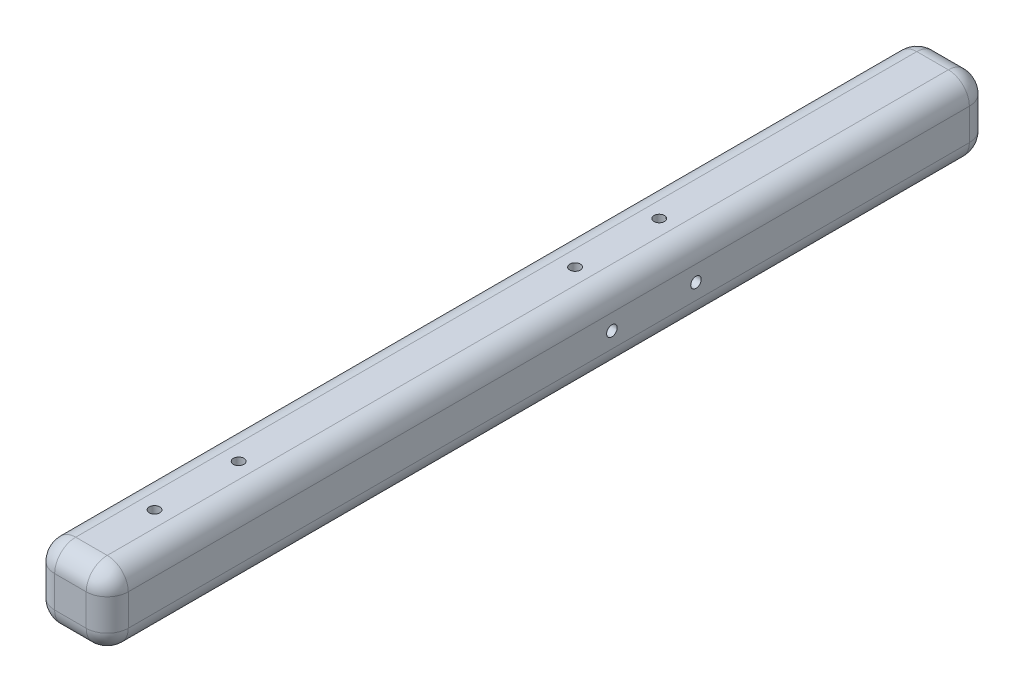
ISO-10303-21;
HEADER;
FILE_DESCRIPTION(('STEP AP214'),'2;1');
FILE_NAME('part.step','',(''),(''),'','','');
FILE_SCHEMA(('AUTOMOTIVE_DESIGN { 1 0 10303 214 1 1 1 1 }'));
ENDSEC;
DATA;
#1=APPLICATION_CONTEXT('core data for automotive mechanical design processes');
#2=APPLICATION_PROTOCOL_DEFINITION('international standard','automotive_design',2000,#1);
#3=PRODUCT_CONTEXT('',#1,'mechanical');
#4=PRODUCT('Part','Part','',(#3));
#5=PRODUCT_RELATED_PRODUCT_CATEGORY('part','',(#4));
#6=PRODUCT_DEFINITION_FORMATION('','',#4);
#7=PRODUCT_DEFINITION_CONTEXT('part definition',#1,'design');
#8=PRODUCT_DEFINITION('design','',#6,#7);
#9=PRODUCT_DEFINITION_SHAPE('','',#8);
#10=(LENGTH_UNIT() NAMED_UNIT(*) SI_UNIT(.MILLI.,.METRE.));
#11=(NAMED_UNIT(*) PLANE_ANGLE_UNIT() SI_UNIT($,.RADIAN.));
#12=(NAMED_UNIT(*) SI_UNIT($,.STERADIAN.) SOLID_ANGLE_UNIT());
#13=UNCERTAINTY_MEASURE_WITH_UNIT(LENGTH_MEASURE(1.E-05),#10,'distance_accuracy_value','');
#14=(GEOMETRIC_REPRESENTATION_CONTEXT(3) GLOBAL_UNCERTAINTY_ASSIGNED_CONTEXT((#13)) GLOBAL_UNIT_ASSIGNED_CONTEXT((#10,
#11,#12)) REPRESENTATION_CONTEXT('',''));
#15=CARTESIAN_POINT('',(0.,0.,0.));
#16=DIRECTION('',(0.,0.,1.));
#17=DIRECTION('',(1.,0.,0.));
#18=AXIS2_PLACEMENT_3D('',#15,#16,#17);
#19=CARTESIAN_POINT('',(-9.525,-9.525,254.));
#20=DIRECTION('',(0.,0.,-1.));
#21=DIRECTION('',(-1.,0.,0.));
#22=AXIS2_PLACEMENT_3D('',#19,#20,#21);
#23=CYLINDRICAL_SURFACE('',#22,12.7);
#24=DIRECTION('',(0.,0.,-1.));
#25=VECTOR('',#24,1.);
#26=CARTESIAN_POINT('',(-9.52499999999991,-22.225,254.));
#27=LINE('',#26,#25);
#28=CARTESIAN_POINT('',(-9.52499999999991,-22.225,520.7));
#29=VERTEX_POINT('',#28);
#30=CARTESIAN_POINT('',(-9.52499999999991,-22.225,12.7));
#31=VERTEX_POINT('',#30);
#32=EDGE_CURVE('E154',#29,#31,#27,.T.);
#33=ORIENTED_EDGE('',*,*,#32,.F.);
#34=CARTESIAN_POINT('',(-9.525,-9.525,520.7));
#35=DIRECTION('',(0.,0.,-1.));
#36=DIRECTION('',(-1.,0.,0.));
#37=AXIS2_PLACEMENT_3D('',#34,#35,#36);
#38=CIRCLE('',#37,12.7);
#39=CARTESIAN_POINT('',(-22.225,-9.52499999999991,520.7));
#40=VERTEX_POINT('',#39);
#41=EDGE_CURVE('E214',#29,#40,#38,.T.);
#42=ORIENTED_EDGE('',*,*,#41,.T.);
#43=DIRECTION('',(0.,0.,-1.));
#44=VECTOR('',#43,1.);
#45=CARTESIAN_POINT('',(-22.225,-9.52499999999991,254.));
#46=LINE('',#45,#44);
#47=CARTESIAN_POINT('',(-22.225,-9.52499999999991,12.7));
#48=VERTEX_POINT('',#47);
#49=EDGE_CURVE('E200',#40,#48,#46,.T.);
#50=ORIENTED_EDGE('',*,*,#49,.T.);
#51=CARTESIAN_POINT('',(-9.525,-9.525,12.7));
#52=DIRECTION('',(0.,0.,-1.));
#53=DIRECTION('',(-1.,0.,0.));
#54=AXIS2_PLACEMENT_3D('',#51,#52,#53);
#55=CIRCLE('',#54,12.7);
#56=EDGE_CURVE('E176',#48,#31,#55,.F.);
#57=ORIENTED_EDGE('',*,*,#56,.T.);
#58=EDGE_LOOP('',(#33,#42,#50,#57));
#59=FACE_BOUND('',#58,.T.);
#60=ADVANCED_FACE('F32',(#59),#23,.T.);
#61=CARTESIAN_POINT('',(-9.52499999999991,-22.225,254.));
#62=DIRECTION('',(0.,1.,0.));
#63=DIRECTION('',(0.,0.,1.));
#64=AXIS2_PLACEMENT_3D('',#61,#62,#63);
#65=PLANE('',#64);
#66=DIRECTION('',(0.,0.,-1.));
#67=VECTOR('',#66,1.);
#68=CARTESIAN_POINT('',(9.52499999999991,-22.225,254.));
#69=LINE('',#68,#67);
#70=CARTESIAN_POINT('',(9.52499999999991,-22.225,520.7));
#71=VERTEX_POINT('',#70);
#72=CARTESIAN_POINT('',(9.52499999999991,-22.225,12.7));
#73=VERTEX_POINT('',#72);
#74=EDGE_CURVE('E158',#71,#73,#69,.T.);
#75=ORIENTED_EDGE('',*,*,#74,.F.);
#76=DIRECTION('',(1.,0.,0.));
#77=VECTOR('',#76,1.);
#78=CARTESIAN_POINT('',(-9.52499999999991,-22.225,520.7));
#79=LINE('',#78,#77);
#80=EDGE_CURVE('E212',#71,#29,#79,.F.);
#81=ORIENTED_EDGE('',*,*,#80,.T.);
#82=ORIENTED_EDGE('',*,*,#32,.T.);
#83=DIRECTION('',(1.,0.,0.));
#84=VECTOR('',#83,1.);
#85=CARTESIAN_POINT('',(9.52499999999991,-22.225,12.7));
#86=LINE('',#85,#84);
#87=EDGE_CURVE('E173',#31,#73,#86,.T.);
#88=ORIENTED_EDGE('',*,*,#87,.T.);
#89=EDGE_LOOP('',(#75,#81,#82,#88));
#90=FACE_BOUND('',#89,.T.);
#91=ADVANCED_FACE('F287',(#90),#65,.F.);
#92=CARTESIAN_POINT('',(9.525,-9.525,254.));
#93=DIRECTION('',(0.,0.,-1.));
#94=DIRECTION('',(-1.,0.,0.));
#95=AXIS2_PLACEMENT_3D('',#92,#93,#94);
#96=CYLINDRICAL_SURFACE('',#95,12.7);
#97=DIRECTION('',(0.,0.,-1.));
#98=VECTOR('',#97,1.);
#99=CARTESIAN_POINT('',(22.225,-9.52499999999991,254.));
#100=LINE('',#99,#98);
#101=CARTESIAN_POINT('',(22.225,-9.52499999999991,520.7));
#102=VERTEX_POINT('',#101);
#103=CARTESIAN_POINT('',(22.225,-9.52499999999991,12.7));
#104=VERTEX_POINT('',#103);
#105=EDGE_CURVE('E276',#102,#104,#100,.T.);
#106=ORIENTED_EDGE('',*,*,#105,.F.);
#107=CARTESIAN_POINT('',(9.525,-9.525,520.7));
#108=DIRECTION('',(0.,0.,-1.));
#109=DIRECTION('',(-1.,0.,0.));
#110=AXIS2_PLACEMENT_3D('',#107,#108,#109);
#111=CIRCLE('',#110,12.7);
#112=EDGE_CURVE('E148',#102,#71,#111,.T.);
#113=ORIENTED_EDGE('',*,*,#112,.T.);
#114=ORIENTED_EDGE('',*,*,#74,.T.);
#115=CARTESIAN_POINT('',(9.525,-9.525,12.7));
#116=DIRECTION('',(0.,0.,-1.));
#117=DIRECTION('',(-1.,0.,0.));
#118=AXIS2_PLACEMENT_3D('',#115,#116,#117);
#119=CIRCLE('',#118,12.7);
#120=EDGE_CURVE('E170',#73,#104,#119,.F.);
#121=ORIENTED_EDGE('',*,*,#120,.T.);
#122=EDGE_LOOP('',(#106,#113,#114,#121));
#123=FACE_BOUND('',#122,.T.);
#124=ADVANCED_FACE('F280',(#123),#96,.T.);
#125=CARTESIAN_POINT('',(22.225,-9.52499999999991,254.));
#126=DIRECTION('',(-1.,0.,0.));
#127=DIRECTION('',(0.,0.,1.));
#128=AXIS2_PLACEMENT_3D('',#125,#126,#127);
#129=PLANE('',#128);
#130=CARTESIAN_POINT('',(22.2250000000006,6.01007305568305E-13,177.799999999995));
#131=DIRECTION('',(1.,0.,0.));
#132=DIRECTION('',(0.,0.,1.));
#133=AXIS2_PLACEMENT_3D('',#130,#131,#132);
#134=CIRCLE('',#133,3.175);
#135=CARTESIAN_POINT('',(22.2250000000006,6.12092758819132E-13,180.974999999995));
#136=VERTEX_POINT('',#135);
#137=EDGE_CURVE('E255',#136,#136,#134,.T.);
#138=ORIENTED_EDGE('',*,*,#137,.F.);
#139=EDGE_LOOP('',(#138));
#140=FACE_BOUND('',#139,.T.);
#141=CARTESIAN_POINT('',(22.2250000000008,6.89690931574916E-13,228.6));
#142=DIRECTION('',(1.,0.,0.));
#143=DIRECTION('',(0.,0.,1.));
#144=AXIS2_PLACEMENT_3D('',#141,#142,#143);
#145=CIRCLE('',#144,3.175);
#146=CARTESIAN_POINT('',(22.2250000000008,7.00776384825743E-13,231.775));
#147=VERTEX_POINT('',#146);
#148=EDGE_CURVE('E245',#147,#147,#145,.T.);
#149=ORIENTED_EDGE('',*,*,#148,.F.);
#150=EDGE_LOOP('',(#149));
#151=FACE_BOUND('',#150,.T.);
#152=DIRECTION('',(0.,0.,-1.));
#153=VECTOR('',#152,1.);
#154=CARTESIAN_POINT('',(22.225,9.52499999999991,254.));
#155=LINE('',#154,#153);
#156=CARTESIAN_POINT('',(22.225,9.52499999999991,520.7));
#157=VERTEX_POINT('',#156);
#158=CARTESIAN_POINT('',(22.225,9.52499999999991,12.7));
#159=VERTEX_POINT('',#158);
#160=EDGE_CURVE('E128',#157,#159,#155,.T.);
#161=ORIENTED_EDGE('',*,*,#160,.F.);
#162=DIRECTION('',(0.,1.,0.));
#163=VECTOR('',#162,1.);
#164=CARTESIAN_POINT('',(22.225,-9.52499999999991,520.7));
#165=LINE('',#164,#163);
#166=EDGE_CURVE('E11',#157,#102,#165,.F.);
#167=ORIENTED_EDGE('',*,*,#166,.T.);
#168=ORIENTED_EDGE('',*,*,#105,.T.);
#169=DIRECTION('',(0.,1.,0.));
#170=VECTOR('',#169,1.);
#171=CARTESIAN_POINT('',(22.225,9.52499999999991,12.7));
#172=LINE('',#171,#170);
#173=EDGE_CURVE('E153',#104,#159,#172,.T.);
#174=ORIENTED_EDGE('',*,*,#173,.T.);
#175=EDGE_LOOP('',(#161,#167,#168,#174));
#176=FACE_BOUND('',#175,.T.);
#177=ADVANCED_FACE('F299',(#140,#151,#176),#129,.F.);
#178=CARTESIAN_POINT('',(9.525,9.525,254.));
#179=DIRECTION('',(0.,0.,-1.));
#180=DIRECTION('',(-1.,0.,0.));
#181=AXIS2_PLACEMENT_3D('',#178,#179,#180);
#182=CYLINDRICAL_SURFACE('',#181,12.7);
#183=DIRECTION('',(0.,0.,-1.));
#184=VECTOR('',#183,1.);
#185=CARTESIAN_POINT('',(9.52499999999991,22.225,254.));
#186=LINE('',#185,#184);
#187=CARTESIAN_POINT('',(9.52499999999991,22.225,520.7));
#188=VERTEX_POINT('',#187);
#189=CARTESIAN_POINT('',(9.52499999999991,22.225,12.7));
#190=VERTEX_POINT('',#189);
#191=EDGE_CURVE('E120',#188,#190,#186,.T.);
#192=ORIENTED_EDGE('',*,*,#191,.F.);
#193=CARTESIAN_POINT('',(9.525,9.525,520.7));
#194=DIRECTION('',(0.,0.,-1.));
#195=DIRECTION('',(-1.,0.,0.));
#196=AXIS2_PLACEMENT_3D('',#193,#194,#195);
#197=CIRCLE('',#196,12.7);
#198=EDGE_CURVE('E41',#188,#157,#197,.T.);
#199=ORIENTED_EDGE('',*,*,#198,.T.);
#200=ORIENTED_EDGE('',*,*,#160,.T.);
#201=CARTESIAN_POINT('',(9.525,9.525,12.7));
#202=DIRECTION('',(0.,0.,-1.));
#203=DIRECTION('',(-1.,0.,0.));
#204=AXIS2_PLACEMENT_3D('',#201,#202,#203);
#205=CIRCLE('',#204,12.7);
#206=EDGE_CURVE('E137',#159,#190,#205,.F.);
#207=ORIENTED_EDGE('',*,*,#206,.T.);
#208=EDGE_LOOP('',(#192,#199,#200,#207));
#209=FACE_BOUND('',#208,.T.);
#210=ADVANCED_FACE('F151',(#209),#182,.T.);
#211=CARTESIAN_POINT('',(-9.52499999999991,22.225,254.));
#212=DIRECTION('',(0.,-1.,0.));
#213=DIRECTION('',(0.,0.,-1.));
#214=AXIS2_PLACEMENT_3D('',#211,#212,#213);
#215=PLANE('',#214);
#216=CARTESIAN_POINT('',(6.62802829628184E-13,22.225,431.800000000005));
#217=DIRECTION('',(0.,1.,0.));
#218=DIRECTION('',(0.,0.,1.));
#219=AXIS2_PLACEMENT_3D('',#216,#217,#218);
#220=CIRCLE('',#219,3.175);
#221=CARTESIAN_POINT('',(6.62802829628184E-13,22.225,434.975000000005));
#222=VERTEX_POINT('',#221);
#223=EDGE_CURVE('E721',#222,#222,#220,.T.);
#224=ORIENTED_EDGE('',*,*,#223,.F.);
#225=EDGE_LOOP('',(#224));
#226=FACE_BOUND('',#225,.T.);
#227=CARTESIAN_POINT('',(7.51486455634769E-13,22.225,482.599999999995));
#228=DIRECTION('',(0.,1.,0.));
#229=DIRECTION('',(0.,0.,1.));
#230=AXIS2_PLACEMENT_3D('',#227,#228,#229);
#231=CIRCLE('',#230,3.175);
#232=CARTESIAN_POINT('',(7.51486455634769E-13,22.225,485.774999999995));
#233=VERTEX_POINT('',#232);
#234=EDGE_CURVE('E715',#233,#233,#231,.T.);
#235=ORIENTED_EDGE('',*,*,#234,.F.);
#236=EDGE_LOOP('',(#235));
#237=FACE_BOUND('',#236,.T.);
#238=CARTESIAN_POINT('',(0.,22.225,177.799999999995));
#239=DIRECTION('',(0.,1.,0.));
#240=DIRECTION('',(0.,0.,1.));
#241=AXIS2_PLACEMENT_3D('',#238,#239,#240);
#242=CIRCLE('',#241,3.175);
#243=CARTESIAN_POINT('',(0.,22.225,180.974999999995));
#244=VERTEX_POINT('',#243);
#245=EDGE_CURVE('E261',#244,#244,#242,.T.);
#246=ORIENTED_EDGE('',*,*,#245,.F.);
#247=EDGE_LOOP('',(#246));
#248=FACE_BOUND('',#247,.T.);
#249=CARTESIAN_POINT('',(0.,22.225,228.6));
#250=DIRECTION('',(0.,1.,0.));
#251=DIRECTION('',(0.,0.,1.));
#252=AXIS2_PLACEMENT_3D('',#249,#250,#251);
#253=CIRCLE('',#252,3.175);
#254=CARTESIAN_POINT('',(0.,22.225,231.775));
#255=VERTEX_POINT('',#254);
#256=EDGE_CURVE('E267',#255,#255,#253,.T.);
#257=ORIENTED_EDGE('',*,*,#256,.F.);
#258=EDGE_LOOP('',(#257));
#259=FACE_BOUND('',#258,.T.);
#260=DIRECTION('',(0.,0.,-1.));
#261=VECTOR('',#260,1.);
#262=CARTESIAN_POINT('',(-9.52499999999991,22.225,254.));
#263=LINE('',#262,#261);
#264=CARTESIAN_POINT('',(-9.52499999999991,22.225,520.7));
#265=VERTEX_POINT('',#264);
#266=CARTESIAN_POINT('',(-9.52499999999991,22.225,12.7));
#267=VERTEX_POINT('',#266);
#268=EDGE_CURVE('E129',#265,#267,#263,.T.);
#269=ORIENTED_EDGE('',*,*,#268,.F.);
#270=DIRECTION('',(-1.,0.,0.));
#271=VECTOR('',#270,1.);
#272=CARTESIAN_POINT('',(-9.52499999999991,22.225,520.7));
#273=LINE('',#272,#271);
#274=EDGE_CURVE('E56',#265,#188,#273,.F.);
#275=ORIENTED_EDGE('',*,*,#274,.T.);
#276=ORIENTED_EDGE('',*,*,#191,.T.);
#277=DIRECTION('',(-1.,0.,0.));
#278=VECTOR('',#277,1.);
#279=CARTESIAN_POINT('',(-9.52499999999991,22.225,12.7));
#280=LINE('',#279,#278);
#281=EDGE_CURVE('E124',#190,#267,#280,.T.);
#282=ORIENTED_EDGE('',*,*,#281,.T.);
#283=EDGE_LOOP('',(#269,#275,#276,#282));
#284=FACE_BOUND('',#283,.T.);
#285=ADVANCED_FACE('F122',(#226,#237,#248,#259,#284),#215,.F.);
#286=CARTESIAN_POINT('',(-9.525,9.525,254.));
#287=DIRECTION('',(0.,0.,-1.));
#288=DIRECTION('',(-1.,0.,0.));
#289=AXIS2_PLACEMENT_3D('',#286,#287,#288);
#290=CYLINDRICAL_SURFACE('',#289,12.7);
#291=DIRECTION('',(0.,0.,-1.));
#292=VECTOR('',#291,1.);
#293=CARTESIAN_POINT('',(-22.225,9.52499999999991,254.));
#294=LINE('',#293,#292);
#295=CARTESIAN_POINT('',(-22.225,9.52499999999991,520.7));
#296=VERTEX_POINT('',#295);
#297=CARTESIAN_POINT('',(-22.225,9.52499999999991,12.7));
#298=VERTEX_POINT('',#297);
#299=EDGE_CURVE('E272',#296,#298,#294,.T.);
#300=ORIENTED_EDGE('',*,*,#299,.F.);
#301=CARTESIAN_POINT('',(-9.525,9.525,520.7));
#302=DIRECTION('',(0.,0.,-1.));
#303=DIRECTION('',(-1.,0.,0.));
#304=AXIS2_PLACEMENT_3D('',#301,#302,#303);
#305=CIRCLE('',#304,12.7);
#306=EDGE_CURVE('E218',#296,#265,#305,.T.);
#307=ORIENTED_EDGE('',*,*,#306,.T.);
#308=ORIENTED_EDGE('',*,*,#268,.T.);
#309=CARTESIAN_POINT('',(-9.525,9.525,12.7));
#310=DIRECTION('',(0.,0.,-1.));
#311=DIRECTION('',(-1.,0.,0.));
#312=AXIS2_PLACEMENT_3D('',#309,#310,#311);
#313=CIRCLE('',#312,12.7);
#314=EDGE_CURVE('E149',#267,#298,#313,.F.);
#315=ORIENTED_EDGE('',*,*,#314,.T.);
#316=EDGE_LOOP('',(#300,#307,#308,#315));
#317=FACE_BOUND('',#316,.T.);
#318=ADVANCED_FACE('F330',(#317),#290,.T.);
#319=CARTESIAN_POINT('',(-22.225,-9.52499999999991,254.));
#320=DIRECTION('',(1.,0.,0.));
#321=DIRECTION('',(0.,0.,-1.));
#322=AXIS2_PLACEMENT_3D('',#319,#320,#321);
#323=PLANE('',#322);
#324=ORIENTED_EDGE('',*,*,#49,.F.);
#325=DIRECTION('',(0.,-1.,0.));
#326=VECTOR('',#325,1.);
#327=CARTESIAN_POINT('',(-22.225,-9.52499999999991,520.7));
#328=LINE('',#327,#326);
#329=EDGE_CURVE('E216',#40,#296,#328,.F.);
#330=ORIENTED_EDGE('',*,*,#329,.T.);
#331=ORIENTED_EDGE('',*,*,#299,.T.);
#332=DIRECTION('',(0.,-1.,0.));
#333=VECTOR('',#332,1.);
#334=CARTESIAN_POINT('',(-22.225,-9.52499999999991,12.7));
#335=LINE('',#334,#333);
#336=EDGE_CURVE('E179',#298,#48,#335,.T.);
#337=ORIENTED_EDGE('',*,*,#336,.T.);
#338=EDGE_LOOP('',(#324,#330,#331,#337));
#339=FACE_BOUND('',#338,.T.);
#340=ADVANCED_FACE('F327',(#339),#323,.F.);
#341=CARTESIAN_POINT('',(-9.525,-9.525,0.));
#342=DIRECTION('',(0.,0.,-1.));
#343=DIRECTION('',(-1.,0.,0.));
#344=AXIS2_PLACEMENT_3D('',#341,#342,#343);
#345=PLANE('',#344);
#346=DIRECTION('',(-1.,0.,0.));
#347=VECTOR('',#346,1.);
#348=CARTESIAN_POINT('',(9.52499999999991,9.525,0.));
#349=LINE('',#348,#347);
#350=CARTESIAN_POINT('',(-9.525,9.525,0.));
#351=VERTEX_POINT('',#350);
#352=CARTESIAN_POINT('',(9.525,9.525,0.));
#353=VERTEX_POINT('',#352);
#354=EDGE_CURVE('E156',#351,#353,#349,.F.);
#355=ORIENTED_EDGE('',*,*,#354,.T.);
#356=DIRECTION('',(0.,1.,0.));
#357=VECTOR('',#356,1.);
#358=CARTESIAN_POINT('',(9.525,-9.52499999999991,0.));
#359=LINE('',#358,#357);
#360=CARTESIAN_POINT('',(9.525,-9.525,0.));
#361=VERTEX_POINT('',#360);
#362=EDGE_CURVE('E167',#353,#361,#359,.F.);
#363=ORIENTED_EDGE('',*,*,#362,.T.);
#364=DIRECTION('',(1.,0.,0.));
#365=VECTOR('',#364,1.);
#366=CARTESIAN_POINT('',(-9.52499999999991,-9.525,0.));
#367=LINE('',#366,#365);
#368=CARTESIAN_POINT('',(-9.525,-9.525,0.));
#369=VERTEX_POINT('',#368);
#370=EDGE_CURVE('E165',#361,#369,#367,.F.);
#371=ORIENTED_EDGE('',*,*,#370,.T.);
#372=DIRECTION('',(0.,-1.,0.));
#373=VECTOR('',#372,1.);
#374=CARTESIAN_POINT('',(-9.525,9.52499999999992,0.));
#375=LINE('',#374,#373);
#376=EDGE_CURVE('E163',#369,#351,#375,.F.);
#377=ORIENTED_EDGE('',*,*,#376,.T.);
#378=EDGE_LOOP('',(#355,#363,#371,#377));
#379=FACE_BOUND('',#378,.T.);
#380=ADVANCED_FACE('F374',(#379),#345,.T.);
#381=CARTESIAN_POINT('',(-9.525,-9.525,12.7));
#382=DIRECTION('',(0.,0.,-1.));
#383=DIRECTION('',(-1.,0.,0.));
#384=AXIS2_PLACEMENT_3D('',#381,#382,#383);
#385=SPHERICAL_SURFACE('',#384,12.7);
#386=CARTESIAN_POINT('',(-9.525,-9.525,12.7));
#387=DIRECTION('',(0.,1.,0.));
#388=DIRECTION('',(-1.,0.,0.));
#389=AXIS2_PLACEMENT_3D('',#386,#387,#388);
#390=CIRCLE('',#389,12.7);
#391=EDGE_CURVE('E194',#369,#48,#390,.T.);
#392=ORIENTED_EDGE('',*,*,#391,.F.);
#393=CARTESIAN_POINT('',(-9.525,-9.525,12.7));
#394=DIRECTION('',(1.,0.,0.));
#395=DIRECTION('',(0.,1.,0.));
#396=AXIS2_PLACEMENT_3D('',#393,#394,#395);
#397=CIRCLE('',#396,12.7);
#398=EDGE_CURVE('E197',#31,#369,#397,.T.);
#399=ORIENTED_EDGE('',*,*,#398,.F.);
#400=ORIENTED_EDGE('',*,*,#56,.F.);
#401=EDGE_LOOP('',(#392,#399,#400));
#402=FACE_BOUND('',#401,.T.);
#403=ADVANCED_FACE('F371',(#402),#385,.T.);
#404=CARTESIAN_POINT('',(-9.52499999999991,-9.525,12.7));
#405=DIRECTION('',(-1.,0.,0.));
#406=DIRECTION('',(0.,0.,1.));
#407=AXIS2_PLACEMENT_3D('',#404,#405,#406);
#408=CYLINDRICAL_SURFACE('',#407,12.7);
#409=ORIENTED_EDGE('',*,*,#398,.T.);
#410=ORIENTED_EDGE('',*,*,#370,.F.);
#411=CARTESIAN_POINT('',(9.52499999999991,-9.525,12.7));
#412=DIRECTION('',(1.,0.,0.));
#413=DIRECTION('',(0.,0.,-1.));
#414=AXIS2_PLACEMENT_3D('',#411,#412,#413);
#415=CIRCLE('',#414,12.7);
#416=EDGE_CURVE('E191',#73,#361,#415,.T.);
#417=ORIENTED_EDGE('',*,*,#416,.F.);
#418=ORIENTED_EDGE('',*,*,#87,.F.);
#419=EDGE_LOOP('',(#409,#410,#417,#418));
#420=FACE_BOUND('',#419,.T.);
#421=ADVANCED_FACE('F291',(#420),#408,.T.);
#422=CARTESIAN_POINT('',(-9.525,-9.52499999999991,12.7));
#423=DIRECTION('',(0.,1.,0.));
#424=DIRECTION('',(0.,0.,1.));
#425=AXIS2_PLACEMENT_3D('',#422,#423,#424);
#426=CYLINDRICAL_SURFACE('',#425,12.7);
#427=ORIENTED_EDGE('',*,*,#391,.T.);
#428=ORIENTED_EDGE('',*,*,#336,.F.);
#429=CARTESIAN_POINT('',(-9.525,9.52499999999991,12.7));
#430=DIRECTION('',(0.,1.,0.));
#431=DIRECTION('',(0.,0.,1.));
#432=AXIS2_PLACEMENT_3D('',#429,#430,#431);
#433=CIRCLE('',#432,12.7);
#434=EDGE_CURVE('E188',#351,#298,#433,.T.);
#435=ORIENTED_EDGE('',*,*,#434,.F.);
#436=ORIENTED_EDGE('',*,*,#376,.F.);
#437=EDGE_LOOP('',(#427,#428,#435,#436));
#438=FACE_BOUND('',#437,.T.);
#439=ADVANCED_FACE('F365',(#438),#426,.T.);
#440=CARTESIAN_POINT('',(9.525,-9.525,12.7));
#441=DIRECTION('',(0.,0.,-1.));
#442=DIRECTION('',(-1.,0.,0.));
#443=AXIS2_PLACEMENT_3D('',#440,#441,#442);
#444=SPHERICAL_SURFACE('',#443,12.7);
#445=ORIENTED_EDGE('',*,*,#120,.F.);
#446=ORIENTED_EDGE('',*,*,#416,.T.);
#447=CARTESIAN_POINT('',(9.525,-9.525,12.7));
#448=DIRECTION('',(0.,1.,0.));
#449=DIRECTION('',(-1.,0.,0.));
#450=AXIS2_PLACEMENT_3D('',#447,#448,#449);
#451=CIRCLE('',#450,12.7);
#452=EDGE_CURVE('E186',#104,#361,#451,.T.);
#453=ORIENTED_EDGE('',*,*,#452,.F.);
#454=EDGE_LOOP('',(#445,#446,#453));
#455=FACE_BOUND('',#454,.T.);
#456=ADVANCED_FACE('F293',(#455),#444,.T.);
#457=CARTESIAN_POINT('',(-9.525,9.525,12.7));
#458=DIRECTION('',(0.,0.,-1.));
#459=DIRECTION('',(-1.,0.,0.));
#460=AXIS2_PLACEMENT_3D('',#457,#458,#459);
#461=SPHERICAL_SURFACE('',#460,12.7);
#462=ORIENTED_EDGE('',*,*,#434,.T.);
#463=ORIENTED_EDGE('',*,*,#314,.F.);
#464=CARTESIAN_POINT('',(-9.525,9.525,12.7));
#465=DIRECTION('',(1.,0.,0.));
#466=DIRECTION('',(0.,1.,0.));
#467=AXIS2_PLACEMENT_3D('',#464,#465,#466);
#468=CIRCLE('',#467,12.7);
#469=EDGE_CURVE('E147',#351,#267,#468,.T.);
#470=ORIENTED_EDGE('',*,*,#469,.F.);
#471=EDGE_LOOP('',(#462,#463,#470));
#472=FACE_BOUND('',#471,.T.);
#473=ADVANCED_FACE('F359',(#472),#461,.T.);
#474=CARTESIAN_POINT('',(9.525,-9.52499999999991,12.7));
#475=DIRECTION('',(0.,-1.,0.));
#476=DIRECTION('',(0.,0.,-1.));
#477=AXIS2_PLACEMENT_3D('',#474,#475,#476);
#478=CYLINDRICAL_SURFACE('',#477,12.7);
#479=ORIENTED_EDGE('',*,*,#452,.T.);
#480=ORIENTED_EDGE('',*,*,#362,.F.);
#481=CARTESIAN_POINT('',(9.525,9.52499999999991,12.7));
#482=DIRECTION('',(0.,1.,0.));
#483=DIRECTION('',(0.,0.,1.));
#484=AXIS2_PLACEMENT_3D('',#481,#482,#483);
#485=CIRCLE('',#484,12.7);
#486=EDGE_CURVE('E139',#159,#353,#485,.T.);
#487=ORIENTED_EDGE('',*,*,#486,.F.);
#488=ORIENTED_EDGE('',*,*,#173,.F.);
#489=EDGE_LOOP('',(#479,#480,#487,#488));
#490=FACE_BOUND('',#489,.T.);
#491=ADVANCED_FACE('F297',(#490),#478,.T.);
#492=CARTESIAN_POINT('',(-9.52499999999991,9.525,12.7));
#493=DIRECTION('',(1.,0.,0.));
#494=DIRECTION('',(0.,0.,-1.));
#495=AXIS2_PLACEMENT_3D('',#492,#493,#494);
#496=CYLINDRICAL_SURFACE('',#495,12.7);
#497=ORIENTED_EDGE('',*,*,#469,.T.);
#498=ORIENTED_EDGE('',*,*,#281,.F.);
#499=CARTESIAN_POINT('',(9.525,9.525,12.7));
#500=DIRECTION('',(1.,0.,0.));
#501=DIRECTION('',(0.,1.,0.));
#502=AXIS2_PLACEMENT_3D('',#499,#500,#501);
#503=CIRCLE('',#502,12.7);
#504=EDGE_CURVE('E135',#353,#190,#503,.T.);
#505=ORIENTED_EDGE('',*,*,#504,.F.);
#506=ORIENTED_EDGE('',*,*,#354,.F.);
#507=EDGE_LOOP('',(#497,#498,#505,#506));
#508=FACE_BOUND('',#507,.T.);
#509=ADVANCED_FACE('F145',(#508),#496,.T.);
#510=CARTESIAN_POINT('',(9.525,9.525,12.7));
#511=DIRECTION('',(0.,0.,-1.));
#512=DIRECTION('',(-1.,0.,0.));
#513=AXIS2_PLACEMENT_3D('',#510,#511,#512);
#514=SPHERICAL_SURFACE('',#513,12.7);
#515=ORIENTED_EDGE('',*,*,#206,.F.);
#516=ORIENTED_EDGE('',*,*,#486,.T.);
#517=ORIENTED_EDGE('',*,*,#504,.T.);
#518=EDGE_LOOP('',(#515,#516,#517));
#519=FACE_BOUND('',#518,.T.);
#520=ADVANCED_FACE('F136',(#519),#514,.T.);
#521=CARTESIAN_POINT('',(0.,9.525,228.6));
#522=DIRECTION('',(0.,1.,0.));
#523=DIRECTION('',(0.,0.,1.));
#524=AXIS2_PLACEMENT_3D('',#521,#522,#523);
#525=CYLINDRICAL_SURFACE('',#524,3.175);
#526=CARTESIAN_POINT('',(0.,9.525,228.6));
#527=DIRECTION('',(0.,1.,0.));
#528=DIRECTION('',(0.,0.,1.));
#529=AXIS2_PLACEMENT_3D('',#526,#527,#528);
#530=CIRCLE('',#529,3.175);
#531=CARTESIAN_POINT('',(0.,9.525,231.775));
#532=VERTEX_POINT('',#531);
#533=EDGE_CURVE('E264',#532,#532,#530,.T.);
#534=ORIENTED_EDGE('',*,*,#533,.F.);
#535=EDGE_LOOP('',(#534));
#536=FACE_BOUND('',#535,.T.);
#537=ORIENTED_EDGE('',*,*,#256,.T.);
#538=EDGE_LOOP('',(#537));
#539=FACE_BOUND('',#538,.T.);
#540=ADVANCED_FACE('F354',(#536,#539),#525,.F.);
#541=CARTESIAN_POINT('',(0.,9.525,228.6));
#542=DIRECTION('',(0.,1.,0.));
#543=DIRECTION('',(0.,0.,1.));
#544=AXIS2_PLACEMENT_3D('',#541,#542,#543);
#545=PLANE('',#544);
#546=ORIENTED_EDGE('',*,*,#533,.T.);
#547=EDGE_LOOP('',(#546));
#548=FACE_BOUND('',#547,.T.);
#549=ADVANCED_FACE('F601',(#548),#545,.T.);
#550=CARTESIAN_POINT('',(0.,9.525,177.799999999995));
#551=DIRECTION('',(0.,1.,0.));
#552=DIRECTION('',(0.,0.,1.));
#553=AXIS2_PLACEMENT_3D('',#550,#551,#552);
#554=CYLINDRICAL_SURFACE('',#553,3.175);
#555=CARTESIAN_POINT('',(0.,9.525,177.799999999995));
#556=DIRECTION('',(0.,1.,0.));
#557=DIRECTION('',(0.,0.,1.));
#558=AXIS2_PLACEMENT_3D('',#555,#556,#557);
#559=CIRCLE('',#558,3.175);
#560=CARTESIAN_POINT('',(0.,9.525,180.974999999995));
#561=VERTEX_POINT('',#560);
#562=EDGE_CURVE('E142',#561,#561,#559,.T.);
#563=ORIENTED_EDGE('',*,*,#562,.F.);
#564=EDGE_LOOP('',(#563));
#565=FACE_BOUND('',#564,.T.);
#566=ORIENTED_EDGE('',*,*,#245,.T.);
#567=EDGE_LOOP('',(#566));
#568=FACE_BOUND('',#567,.T.);
#569=ADVANCED_FACE('F592',(#565,#568),#554,.F.);
#570=CARTESIAN_POINT('',(0.,9.525,177.799999999995));
#571=DIRECTION('',(0.,1.,0.));
#572=DIRECTION('',(0.,0.,1.));
#573=AXIS2_PLACEMENT_3D('',#570,#571,#572);
#574=PLANE('',#573);
#575=ORIENTED_EDGE('',*,*,#562,.T.);
#576=EDGE_LOOP('',(#575));
#577=FACE_BOUND('',#576,.T.);
#578=ADVANCED_FACE('F583',(#577),#574,.T.);
#579=CARTESIAN_POINT('',(9.5250000000008,7.34032744578224E-13,228.6));
#580=DIRECTION('',(1.,0.,0.));
#581=DIRECTION('',(0.,1.,0.));
#582=AXIS2_PLACEMENT_3D('',#579,#580,#581);
#583=CYLINDRICAL_SURFACE('',#582,3.175);
#584=CARTESIAN_POINT('',(9.5250000000008,7.34032744578224E-13,228.6));
#585=DIRECTION('',(1.,0.,0.));
#586=DIRECTION('',(0.,0.,1.));
#587=AXIS2_PLACEMENT_3D('',#584,#585,#586);
#588=CIRCLE('',#587,3.175);
#589=CARTESIAN_POINT('',(9.52500000000081,7.45118197829051E-13,231.775));
#590=VERTEX_POINT('',#589);
#591=EDGE_CURVE('E250',#590,#590,#588,.T.);
#592=ORIENTED_EDGE('',*,*,#591,.F.);
#593=EDGE_LOOP('',(#592));
#594=FACE_BOUND('',#593,.T.);
#595=ORIENTED_EDGE('',*,*,#148,.T.);
#596=EDGE_LOOP('',(#595));
#597=FACE_BOUND('',#596,.T.);
#598=ADVANCED_FACE('F574',(#594,#597),#583,.F.);
#599=CARTESIAN_POINT('',(9.5250000000008,7.34032744578224E-13,228.6));
#600=DIRECTION('',(1.,0.,0.));
#601=DIRECTION('',(0.,0.,1.));
#602=AXIS2_PLACEMENT_3D('',#599,#600,#601);
#603=PLANE('',#602);
#604=ORIENTED_EDGE('',*,*,#591,.T.);
#605=EDGE_LOOP('',(#604));
#606=FACE_BOUND('',#605,.T.);
#607=ADVANCED_FACE('F565',(#606),#603,.T.);
#608=CARTESIAN_POINT('',(9.52500000000062,6.45349118571612E-13,177.799999999995));
#609=DIRECTION('',(1.,0.,0.));
#610=DIRECTION('',(0.,1.,0.));
#611=AXIS2_PLACEMENT_3D('',#608,#609,#610);
#612=CYLINDRICAL_SURFACE('',#611,3.175);
#613=CARTESIAN_POINT('',(9.52500000000062,6.45349118571612E-13,177.799999999995));
#614=DIRECTION('',(1.,0.,0.));
#615=DIRECTION('',(0.,0.,1.));
#616=AXIS2_PLACEMENT_3D('',#613,#614,#615);
#617=CIRCLE('',#616,3.175);
#618=CARTESIAN_POINT('',(9.52500000000063,6.56434571822439E-13,180.974999999995));
#619=VERTEX_POINT('',#618);
#620=EDGE_CURVE('E270',#619,#619,#617,.T.);
#621=ORIENTED_EDGE('',*,*,#620,.F.);
#622=EDGE_LOOP('',(#621));
#623=FACE_BOUND('',#622,.T.);
#624=ORIENTED_EDGE('',*,*,#137,.T.);
#625=EDGE_LOOP('',(#624));
#626=FACE_BOUND('',#625,.T.);
#627=ADVANCED_FACE('F556',(#623,#626),#612,.F.);
#628=CARTESIAN_POINT('',(9.52500000000062,6.45349118571612E-13,177.799999999995));
#629=DIRECTION('',(1.,0.,0.));
#630=DIRECTION('',(0.,0.,1.));
#631=AXIS2_PLACEMENT_3D('',#628,#629,#630);
#632=PLANE('',#631);
#633=ORIENTED_EDGE('',*,*,#620,.T.);
#634=EDGE_LOOP('',(#633));
#635=FACE_BOUND('',#634,.T.);
#636=ADVANCED_FACE('F472',(#635),#632,.T.);
#637=CARTESIAN_POINT('',(-9.525,-9.525,533.4));
#638=DIRECTION('',(0.,0.,-1.));
#639=DIRECTION('',(-1.,0.,0.));
#640=AXIS2_PLACEMENT_3D('',#637,#638,#639);
#641=PLANE('',#640);
#642=DIRECTION('',(0.,-1.,0.));
#643=VECTOR('',#642,1.);
#644=CARTESIAN_POINT('',(-9.525,-9.525,533.4));
#645=LINE('',#644,#643);
#646=CARTESIAN_POINT('',(-9.525,9.525,533.4));
#647=VERTEX_POINT('',#646);
#648=CARTESIAN_POINT('',(-9.525,-9.525,533.4));
#649=VERTEX_POINT('',#648);
#650=EDGE_CURVE('E207',#647,#649,#645,.T.);
#651=ORIENTED_EDGE('',*,*,#650,.T.);
#652=DIRECTION('',(1.,0.,0.));
#653=VECTOR('',#652,1.);
#654=CARTESIAN_POINT('',(-9.525,-9.525,533.4));
#655=LINE('',#654,#653);
#656=CARTESIAN_POINT('',(9.525,-9.525,533.4));
#657=VERTEX_POINT('',#656);
#658=EDGE_CURVE('E209',#649,#657,#655,.T.);
#659=ORIENTED_EDGE('',*,*,#658,.T.);
#660=DIRECTION('',(0.,1.,0.));
#661=VECTOR('',#660,1.);
#662=CARTESIAN_POINT('',(9.525,-9.525,533.4));
#663=LINE('',#662,#661);
#664=CARTESIAN_POINT('',(9.525,9.525,533.4));
#665=VERTEX_POINT('',#664);
#666=EDGE_CURVE('E203',#657,#665,#663,.T.);
#667=ORIENTED_EDGE('',*,*,#666,.T.);
#668=DIRECTION('',(-1.,0.,0.));
#669=VECTOR('',#668,1.);
#670=CARTESIAN_POINT('',(-9.525,9.525,533.4));
#671=LINE('',#670,#669);
#672=EDGE_CURVE('E205',#665,#647,#671,.T.);
#673=ORIENTED_EDGE('',*,*,#672,.T.);
#674=EDGE_LOOP('',(#651,#659,#667,#673));
#675=FACE_BOUND('',#674,.T.);
#676=ADVANCED_FACE('F312',(#675),#641,.F.);
#677=CARTESIAN_POINT('',(-9.525,9.525,520.7));
#678=DIRECTION('',(0.,0.,-1.));
#679=DIRECTION('',(-1.,0.,0.));
#680=AXIS2_PLACEMENT_3D('',#677,#678,#679);
#681=SPHERICAL_SURFACE('',#680,12.7);
#682=CARTESIAN_POINT('',(-9.525,9.525,520.7));
#683=DIRECTION('',(1.,0.,0.));
#684=DIRECTION('',(0.,1.,0.));
#685=AXIS2_PLACEMENT_3D('',#682,#683,#684);
#686=CIRCLE('',#685,12.7);
#687=EDGE_CURVE('E238',#265,#647,#686,.T.);
#688=ORIENTED_EDGE('',*,*,#687,.F.);
#689=ORIENTED_EDGE('',*,*,#306,.F.);
#690=CARTESIAN_POINT('',(-9.525,9.525,520.7));
#691=DIRECTION('',(0.,-1.,0.));
#692=DIRECTION('',(1.,0.,0.));
#693=AXIS2_PLACEMENT_3D('',#690,#691,#692);
#694=CIRCLE('',#693,12.7);
#695=EDGE_CURVE('E36',#647,#296,#694,.T.);
#696=ORIENTED_EDGE('',*,*,#695,.F.);
#697=EDGE_LOOP('',(#688,#689,#696));
#698=FACE_BOUND('',#697,.T.);
#699=ADVANCED_FACE('F34',(#698),#681,.T.);
#700=CARTESIAN_POINT('',(-9.525,-9.525,520.7));
#701=DIRECTION('',(0.,-1.,0.));
#702=DIRECTION('',(0.,0.,-1.));
#703=AXIS2_PLACEMENT_3D('',#700,#701,#702);
#704=CYLINDRICAL_SURFACE('',#703,12.7);
#705=ORIENTED_EDGE('',*,*,#695,.T.);
#706=ORIENTED_EDGE('',*,*,#329,.F.);
#707=CARTESIAN_POINT('',(-9.525,-9.525,520.7));
#708=DIRECTION('',(0.,-1.,0.));
#709=DIRECTION('',(1.,0.,0.));
#710=AXIS2_PLACEMENT_3D('',#707,#708,#709);
#711=CIRCLE('',#710,12.7);
#712=EDGE_CURVE('E236',#649,#40,#711,.T.);
#713=ORIENTED_EDGE('',*,*,#712,.F.);
#714=ORIENTED_EDGE('',*,*,#650,.F.);
#715=EDGE_LOOP('',(#705,#706,#713,#714));
#716=FACE_BOUND('',#715,.T.);
#717=ADVANCED_FACE('F324',(#716),#704,.T.);
#718=CARTESIAN_POINT('',(-9.525,9.525,520.7));
#719=DIRECTION('',(-1.,0.,0.));
#720=DIRECTION('',(0.,0.,1.));
#721=AXIS2_PLACEMENT_3D('',#718,#719,#720);
#722=CYLINDRICAL_SURFACE('',#721,12.7);
#723=ORIENTED_EDGE('',*,*,#687,.T.);
#724=ORIENTED_EDGE('',*,*,#672,.F.);
#725=CARTESIAN_POINT('',(9.52499999999991,9.525,520.7));
#726=DIRECTION('',(1.,0.,0.));
#727=DIRECTION('',(0.,0.,-1.));
#728=AXIS2_PLACEMENT_3D('',#725,#726,#727);
#729=CIRCLE('',#728,12.7);
#730=EDGE_CURVE('E233',#188,#665,#729,.T.);
#731=ORIENTED_EDGE('',*,*,#730,.F.);
#732=ORIENTED_EDGE('',*,*,#274,.F.);
#733=EDGE_LOOP('',(#723,#724,#731,#732));
#734=FACE_BOUND('',#733,.T.);
#735=ADVANCED_FACE('F333',(#734),#722,.T.);
#736=CARTESIAN_POINT('',(-9.525,-9.525,520.7));
#737=DIRECTION('',(0.,0.,-1.));
#738=DIRECTION('',(-1.,0.,0.));
#739=AXIS2_PLACEMENT_3D('',#736,#737,#738);
#740=SPHERICAL_SURFACE('',#739,12.7);
#741=ORIENTED_EDGE('',*,*,#712,.T.);
#742=ORIENTED_EDGE('',*,*,#41,.F.);
#743=CARTESIAN_POINT('',(-9.525,-9.525,520.7));
#744=DIRECTION('',(1.,0.,0.));
#745=DIRECTION('',(0.,1.,0.));
#746=AXIS2_PLACEMENT_3D('',#743,#744,#745);
#747=CIRCLE('',#746,12.7);
#748=EDGE_CURVE('E230',#649,#29,#747,.T.);
#749=ORIENTED_EDGE('',*,*,#748,.F.);
#750=EDGE_LOOP('',(#741,#742,#749));
#751=FACE_BOUND('',#750,.T.);
#752=ADVANCED_FACE('F323',(#751),#740,.T.);
#753=CARTESIAN_POINT('',(9.525,9.525,520.7));
#754=DIRECTION('',(0.,0.,-1.));
#755=DIRECTION('',(-1.,0.,0.));
#756=AXIS2_PLACEMENT_3D('',#753,#754,#755);
#757=SPHERICAL_SURFACE('',#756,12.7);
#758=ORIENTED_EDGE('',*,*,#198,.F.);
#759=ORIENTED_EDGE('',*,*,#730,.T.);
#760=CARTESIAN_POINT('',(9.525,9.525,520.7));
#761=DIRECTION('',(0.,-1.,0.));
#762=DIRECTION('',(1.,0.,0.));
#763=AXIS2_PLACEMENT_3D('',#760,#761,#762);
#764=CIRCLE('',#763,12.7);
#765=EDGE_CURVE('E227',#157,#665,#764,.T.);
#766=ORIENTED_EDGE('',*,*,#765,.F.);
#767=EDGE_LOOP('',(#758,#759,#766));
#768=FACE_BOUND('',#767,.T.);
#769=ADVANCED_FACE('F335',(#768),#757,.T.);
#770=CARTESIAN_POINT('',(-9.525,-9.525,520.7));
#771=DIRECTION('',(1.,0.,0.));
#772=DIRECTION('',(0.,0.,-1.));
#773=AXIS2_PLACEMENT_3D('',#770,#771,#772);
#774=CYLINDRICAL_SURFACE('',#773,12.7);
#775=ORIENTED_EDGE('',*,*,#748,.T.);
#776=ORIENTED_EDGE('',*,*,#80,.F.);
#777=CARTESIAN_POINT('',(9.525,-9.525,520.7));
#778=DIRECTION('',(1.,0.,0.));
#779=DIRECTION('',(0.,1.,0.));
#780=AXIS2_PLACEMENT_3D('',#777,#778,#779);
#781=CIRCLE('',#780,12.7);
#782=EDGE_CURVE('E224',#657,#71,#781,.T.);
#783=ORIENTED_EDGE('',*,*,#782,.F.);
#784=ORIENTED_EDGE('',*,*,#658,.F.);
#785=EDGE_LOOP('',(#775,#776,#783,#784));
#786=FACE_BOUND('',#785,.T.);
#787=ADVANCED_FACE('F315',(#786),#774,.T.);
#788=CARTESIAN_POINT('',(9.525,-9.525,520.7));
#789=DIRECTION('',(0.,1.,0.));
#790=DIRECTION('',(0.,0.,1.));
#791=AXIS2_PLACEMENT_3D('',#788,#789,#790);
#792=CYLINDRICAL_SURFACE('',#791,12.7);
#793=ORIENTED_EDGE('',*,*,#765,.T.);
#794=ORIENTED_EDGE('',*,*,#666,.F.);
#795=CARTESIAN_POINT('',(9.525,-9.52499999999991,520.7));
#796=DIRECTION('',(0.,-1.,0.));
#797=DIRECTION('',(0.,0.,-1.));
#798=AXIS2_PLACEMENT_3D('',#795,#796,#797);
#799=CIRCLE('',#798,12.7);
#800=EDGE_CURVE('E222',#102,#657,#799,.T.);
#801=ORIENTED_EDGE('',*,*,#800,.F.);
#802=ORIENTED_EDGE('',*,*,#166,.F.);
#803=EDGE_LOOP('',(#793,#794,#801,#802));
#804=FACE_BOUND('',#803,.T.);
#805=ADVANCED_FACE('F309',(#804),#792,.T.);
#806=CARTESIAN_POINT('',(9.525,-9.525,520.7));
#807=DIRECTION('',(0.,0.,-1.));
#808=DIRECTION('',(-1.,0.,0.));
#809=AXIS2_PLACEMENT_3D('',#806,#807,#808);
#810=SPHERICAL_SURFACE('',#809,12.7);
#811=ORIENTED_EDGE('',*,*,#782,.T.);
#812=ORIENTED_EDGE('',*,*,#112,.F.);
#813=ORIENTED_EDGE('',*,*,#800,.T.);
#814=EDGE_LOOP('',(#811,#812,#813));
#815=FACE_BOUND('',#814,.T.);
#816=ADVANCED_FACE('F304',(#815),#810,.T.);
#817=CARTESIAN_POINT('',(7.51486455634769E-13,9.525,482.599999999995));
#818=DIRECTION('',(0.,1.,0.));
#819=DIRECTION('',(0.,0.,1.));
#820=AXIS2_PLACEMENT_3D('',#817,#818,#819);
#821=CYLINDRICAL_SURFACE('',#820,3.175);
#822=CARTESIAN_POINT('',(7.51486455634769E-13,9.525,482.599999999995));
#823=DIRECTION('',(0.,1.,0.));
#824=DIRECTION('',(0.,0.,1.));
#825=AXIS2_PLACEMENT_3D('',#822,#823,#824);
#826=CIRCLE('',#825,3.175);
#827=CARTESIAN_POINT('',(7.51486455634769E-13,9.525,485.774999999995));
#828=VERTEX_POINT('',#827);
#829=EDGE_CURVE('E718',#828,#828,#826,.T.);
#830=ORIENTED_EDGE('',*,*,#829,.F.);
#831=EDGE_LOOP('',(#830));
#832=FACE_BOUND('',#831,.T.);
#833=ORIENTED_EDGE('',*,*,#234,.T.);
#834=EDGE_LOOP('',(#833));
#835=FACE_BOUND('',#834,.T.);
#836=ADVANCED_FACE('F378',(#832,#835),#821,.F.);
#837=CARTESIAN_POINT('',(7.51486455634769E-13,9.525,482.599999999995));
#838=DIRECTION('',(0.,1.,0.));
#839=DIRECTION('',(0.,0.,1.));
#840=AXIS2_PLACEMENT_3D('',#837,#838,#839);
#841=PLANE('',#840);
#842=ORIENTED_EDGE('',*,*,#829,.T.);
#843=EDGE_LOOP('',(#842));
#844=FACE_BOUND('',#843,.T.);
#845=ADVANCED_FACE('F395',(#844),#841,.T.);
#846=CARTESIAN_POINT('',(6.62802829628184E-13,9.525,431.800000000005));
#847=DIRECTION('',(0.,1.,0.));
#848=DIRECTION('',(0.,0.,1.));
#849=AXIS2_PLACEMENT_3D('',#846,#847,#848);
#850=CYLINDRICAL_SURFACE('',#849,3.175);
#851=CARTESIAN_POINT('',(6.62802829628184E-13,9.525,431.800000000005));
#852=DIRECTION('',(0.,1.,0.));
#853=DIRECTION('',(0.,0.,1.));
#854=AXIS2_PLACEMENT_3D('',#851,#852,#853);
#855=CIRCLE('',#854,3.175);
#856=CARTESIAN_POINT('',(6.62802829628184E-13,9.525,434.975000000005));
#857=VERTEX_POINT('',#856);
#858=EDGE_CURVE('E225',#857,#857,#855,.T.);
#859=ORIENTED_EDGE('',*,*,#858,.F.);
#860=EDGE_LOOP('',(#859));
#861=FACE_BOUND('',#860,.T.);
#862=ORIENTED_EDGE('',*,*,#223,.T.);
#863=EDGE_LOOP('',(#862));
#864=FACE_BOUND('',#863,.T.);
#865=ADVANCED_FACE('F403',(#861,#864),#850,.F.);
#866=CARTESIAN_POINT('',(6.62802829628184E-13,9.525,431.800000000005));
#867=DIRECTION('',(0.,1.,0.));
#868=DIRECTION('',(0.,0.,1.));
#869=AXIS2_PLACEMENT_3D('',#866,#867,#868);
#870=PLANE('',#869);
#871=ORIENTED_EDGE('',*,*,#858,.T.);
#872=EDGE_LOOP('',(#871));
#873=FACE_BOUND('',#872,.T.);
#874=ADVANCED_FACE('F411',(#873),#870,.T.);
#875=CLOSED_SHELL('',(#60,#91,#124,#177,#210,#285,#318,#340,#380,#403,#421,#439,#456,#473,#491,
#509,#520,#540,#549,#569,#578,#598,#607,#627,#636,#676,#699,#717,#735,#752,#769,#787,#805,#816,
#836,#845,#865,#874));
#876=MANIFOLD_SOLID_BREP('B2',#875);
#877=ADVANCED_BREP_SHAPE_REPRESENTATION('',(#18,#876),#14);
#878=SHAPE_DEFINITION_REPRESENTATION(#9,#877);
ENDSEC;
END-ISO-10303-21;
